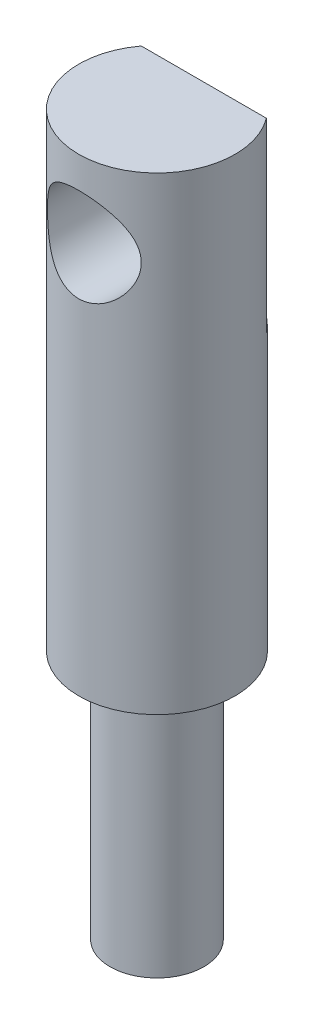
ISO-10303-21;
HEADER;
FILE_DESCRIPTION(('STEP AP214'),'2;1');
FILE_NAME('part.step','',(''),(''),'','','');
FILE_SCHEMA(('AUTOMOTIVE_DESIGN { 1 0 10303 214 1 1 1 1 }'));
ENDSEC;
DATA;
#1=APPLICATION_CONTEXT('core data for automotive mechanical design processes');
#2=APPLICATION_PROTOCOL_DEFINITION('international standard','automotive_design',2000,#1);
#3=PRODUCT_CONTEXT('',#1,'mechanical');
#4=PRODUCT('Part','Part','',(#3));
#5=PRODUCT_RELATED_PRODUCT_CATEGORY('part','',(#4));
#6=PRODUCT_DEFINITION_FORMATION('','',#4);
#7=PRODUCT_DEFINITION_CONTEXT('part definition',#1,'design');
#8=PRODUCT_DEFINITION('design','',#6,#7);
#9=PRODUCT_DEFINITION_SHAPE('','',#8);
#10=(LENGTH_UNIT() NAMED_UNIT(*) SI_UNIT(.MILLI.,.METRE.));
#11=(NAMED_UNIT(*) PLANE_ANGLE_UNIT() SI_UNIT($,.RADIAN.));
#12=(NAMED_UNIT(*) SI_UNIT($,.STERADIAN.) SOLID_ANGLE_UNIT());
#13=UNCERTAINTY_MEASURE_WITH_UNIT(LENGTH_MEASURE(1.E-05),#10,'distance_accuracy_value','');
#14=(GEOMETRIC_REPRESENTATION_CONTEXT(3) GLOBAL_UNCERTAINTY_ASSIGNED_CONTEXT((#13)) GLOBAL_UNIT_ASSIGNED_CONTEXT((#10,
#11,#12)) REPRESENTATION_CONTEXT('',''));
#15=CARTESIAN_POINT('',(0.,0.,0.));
#16=DIRECTION('',(0.,0.,1.));
#17=DIRECTION('',(1.,0.,0.));
#18=AXIS2_PLACEMENT_3D('',#15,#16,#17);
#19=CARTESIAN_POINT('',(0.,0.,0.));
#20=DIRECTION('',(0.,-1.,0.));
#21=DIRECTION('',(0.,0.,-1.));
#22=AXIS2_PLACEMENT_3D('',#19,#20,#21);
#23=PLANE('',#22);
#24=CARTESIAN_POINT('',(0.,0.,0.));
#25=DIRECTION('',(0.,1.,0.));
#26=DIRECTION('',(0.,0.,1.));
#27=AXIS2_PLACEMENT_3D('',#24,#25,#26);
#28=CIRCLE('',#27,2.5);
#29=CARTESIAN_POINT('',(-2.,0.,-1.5));
#30=VERTEX_POINT('',#29);
#31=CARTESIAN_POINT('',(2.,0.,-1.5));
#32=VERTEX_POINT('',#31);
#33=EDGE_CURVE('E11',#30,#32,#28,.T.);
#34=ORIENTED_EDGE('',*,*,#33,.T.);
#35=DIRECTION('',(1.,0.,0.));
#36=VECTOR('',#35,1.);
#37=CARTESIAN_POINT('',(-2.,0.,-1.5));
#38=LINE('',#37,#36);
#39=EDGE_CURVE('E66',#30,#32,#38,.T.);
#40=ORIENTED_EDGE('',*,*,#39,.F.);
#41=EDGE_LOOP('',(#34,#40));
#42=FACE_BOUND('',#41,.T.);
#43=ADVANCED_FACE('F38',(#42),#23,.F.);
#44=CARTESIAN_POINT('',(0.,9.18603512762904,0.));
#45=DIRECTION('',(0.,1.,0.));
#46=DIRECTION('',(0.,0.,1.));
#47=AXIS2_PLACEMENT_3D('',#44,#45,#46);
#48=CYLINDRICAL_SURFACE('',#47,2.5);
#49=CARTESIAN_POINT('',(0.,-4.,2.5));
#50=CARTESIAN_POINT('',(-0.0767298334620158,-3.99999590899012,2.49999625789732));
#51=CARTESIAN_POINT('',(-0.153582320644178,-3.99407132907374,2.4964290461501));
#52=CARTESIAN_POINT('',(-0.304975509530679,-3.97067568048467,2.48249903608568));
#53=CARTESIAN_POINT('',(-0.379510034596047,-3.95317613814578,2.47211948032719));
#54=CARTESIAN_POINT('',(-0.523751827790837,-3.90761363883314,2.44561558054488));
#55=CARTESIAN_POINT('',(-0.593481028226566,-3.87960304183684,2.42951973272944));
#56=CARTESIAN_POINT('',(-0.727030318214659,-3.81413966685897,2.39295367626407));
#57=CARTESIAN_POINT('',(-0.790851869416383,-3.77668923303125,2.37248455380255));
#58=CARTESIAN_POINT('',(-0.916299278999315,-3.69022517329142,2.32705360719088));
#59=CARTESIAN_POINT('',(-0.977384020081415,-3.64054630464861,2.30186792195985));
#60=CARTESIAN_POINT('',(-1.09088270411891,-3.53253279617173,2.25030439279634));
#61=CARTESIAN_POINT('',(-1.14328534948112,-3.47418706281268,2.22392505153571));
#62=CARTESIAN_POINT('',(-1.24444996762974,-3.34207648950327,2.1691106699591));
#63=CARTESIAN_POINT('',(-1.29197766378809,-3.26729822901871,2.14082017703649));
#64=CARTESIAN_POINT('',(-1.37361437764896,-3.10915342675689,2.08938301412124));
#65=CARTESIAN_POINT('',(-1.4077451733516,-3.02580110375243,2.06622802273938));
#66=CARTESIAN_POINT('',(-1.45440601714221,-2.87340354934676,2.0335462966093));
#67=CARTESIAN_POINT('',(-1.47016197246826,-2.80576400138968,2.02207883137591));
#68=CARTESIAN_POINT('',(-1.49216172340475,-2.66819628416964,2.00590308295503));
#69=CARTESIAN_POINT('',(-1.49841734556836,-2.59827107124551,2.0011863964376));
#70=CARTESIAN_POINT('',(-1.50105508796009,-2.45798850578267,1.99920922463856));
#71=CARTESIAN_POINT('',(-1.49741783408418,-2.3876305749068,2.00196337012718));
#72=CARTESIAN_POINT('',(-1.48046060478828,-2.24872122457241,2.01453261443742));
#73=CARTESIAN_POINT('',(-1.46713334620103,-2.18017120415256,2.02435302432226));
#74=CARTESIAN_POINT('',(-1.43173921881792,-2.0474697578719,2.04953186944258));
#75=CARTESIAN_POINT('',(-1.40978748666087,-1.98327294607552,2.06481711652537));
#76=CARTESIAN_POINT('',(-1.35795061770837,-1.85930500907188,2.09927051350828));
#77=CARTESIAN_POINT('',(-1.32806257259705,-1.79953551657608,2.11844008623465));
#78=CARTESIAN_POINT('',(-1.25517983184583,-1.6750159028772,2.16255327268985));
#79=CARTESIAN_POINT('',(-1.21080724397723,-1.61122190704507,2.18792043372992));
#80=CARTESIAN_POINT('',(-1.11291092784003,-1.49132351633299,2.23930599764381));
#81=CARTESIAN_POINT('',(-1.05937845100579,-1.43522656602349,2.26532500262149));
#82=CARTESIAN_POINT('',(-0.935811834382966,-1.32438701817824,2.31935504958317));
#83=CARTESIAN_POINT('',(-0.864517682704957,-1.27092269398401,2.34713836268532));
#84=CARTESIAN_POINT('',(-0.712276050459,-1.17687795280209,2.39772428433981));
#85=CARTESIAN_POINT('',(-0.631333763943564,-1.13629064621005,2.42052955425515));
#86=CARTESIAN_POINT('',(-0.467197585268207,-1.0720678172041,2.45730392066151));
#87=CARTESIAN_POINT('',(-0.384467624173581,-1.04752464428409,2.47173957439704));
#88=CARTESIAN_POINT('',(-0.215047895144641,-1.01298880259462,2.49218842813551));
#89=CARTESIAN_POINT('',(-0.12836300566132,-1.00297868224643,2.49821172952738));
#90=CARTESIAN_POINT('',(0.0337146143773955,-0.99849215232169,2.5009057037461));
#91=CARTESIAN_POINT('',(0.109042473418717,-1.00209114491483,2.49873521714286));
#92=CARTESIAN_POINT('',(0.25782940198606,-1.02042585307192,2.48778712087049));
#93=CARTESIAN_POINT('',(0.331288509376105,-1.03516134280581,2.47900964518037));
#94=CARTESIAN_POINT('',(0.472574932157612,-1.07454343281246,2.45594792442191));
#95=CARTESIAN_POINT('',(0.540495750928482,-1.09894034907347,2.44180275662555));
#96=CARTESIAN_POINT('',(0.671265749087261,-1.15667737636527,2.40913880862845));
#97=CARTESIAN_POINT('',(0.734113924963907,-1.19001925134667,2.39061916586511));
#98=CARTESIAN_POINT('',(0.860006262823862,-1.2685569792087,2.34845496237361));
#99=CARTESIAN_POINT('',(0.922394150456836,-1.31462382907839,2.3244780273988));
#100=CARTESIAN_POINT('',(1.03902603131014,-1.41539139348862,2.27474265574732));
#101=CARTESIAN_POINT('',(1.09326040273738,-1.47010215485253,2.24898216586361));
#102=CARTESIAN_POINT('',(1.19931996735579,-1.59491039003715,2.19445423909891));
#103=CARTESIAN_POINT('',(1.24991019630915,-1.6660838854655,2.16573241746291));
#104=CARTESIAN_POINT('',(1.33845238915667,-1.8172160245682,2.1121618206671));
#105=CARTESIAN_POINT('',(1.37641766769781,-1.89716529389278,2.0873089799769));
#106=CARTESIAN_POINT('',(1.43142578795776,-2.04624302230669,2.04984909240519));
#107=CARTESIAN_POINT('',(1.4512162533619,-2.11398031235859,2.03575659328729));
#108=CARTESIAN_POINT('',(1.48113663905972,-2.2525320780801,2.01409605743544));
#109=CARTESIAN_POINT('',(1.49127995297631,-2.32334214432783,2.00651897642721));
#110=CARTESIAN_POINT('',(1.50134130416631,-2.46637694759703,1.99900446616268));
#111=CARTESIAN_POINT('',(1.50122089107869,-2.53860599068704,1.99909576445937));
#112=CARTESIAN_POINT('',(1.49066472959328,-2.68189443560946,2.0069771789285));
#113=CARTESIAN_POINT('',(1.48022337215759,-2.7529531800806,2.0147714813882));
#114=CARTESIAN_POINT('',(1.45040174148913,-2.88848841757219,2.0363318524298));
#115=CARTESIAN_POINT('',(1.43147636845351,-2.95311709430687,2.04979211805581));
#116=CARTESIAN_POINT('',(1.38563242076993,-3.07833725447422,2.08105501960152));
#117=CARTESIAN_POINT('',(1.35871083588479,-3.13892720696055,2.09885929040482));
#118=CARTESIAN_POINT('',(1.29289245555732,-3.26431985722078,2.14012990550917));
#119=CARTESIAN_POINT('',(1.25279167675753,-3.32834110385431,2.1640458758264));
#120=CARTESIAN_POINT('',(1.16375698389084,-3.44938007261729,2.21320127030768));
#121=CARTESIAN_POINT('',(1.11481579607798,-3.50639196215256,2.23844177205021));
#122=CARTESIAN_POINT('',(1.00009777425734,-3.62135094913167,2.29225690291476));
#123=CARTESIAN_POINT('',(0.932876819313904,-3.67793107489619,2.32070308663658));
#124=CARTESIAN_POINT('',(0.788462434445589,-3.77909785586331,2.37365428872367));
#125=CARTESIAN_POINT('',(0.71126544450154,-3.82368021198479,2.39815789310936));
#126=CARTESIAN_POINT('',(0.551125230801454,-3.89778580757374,2.43985578654394));
#127=CARTESIAN_POINT('',(0.468430086957214,-3.92772806492683,2.45725077479787));
#128=CARTESIAN_POINT('',(0.297973306118807,-3.97272469521097,2.48366273001246));
#129=CARTESIAN_POINT('',(0.210232099648612,-3.98783516785699,2.49271125871485));
#130=CARTESIAN_POINT('',(0.101558096917536,-3.99669745470866,2.49802001168187));
#131=CARTESIAN_POINT('',(0.0812762590282775,-3.99793441730609,2.49876114656362));
#132=CARTESIAN_POINT('',(0.0406658206871124,-3.99958624637086,2.49975164517367));
#133=CARTESIAN_POINT('',(0.0203372186375695,-4.0000010843209,2.50000099184316));
#134=CARTESIAN_POINT('',(0.,-4.,2.5));
#135=B_SPLINE_CURVE_WITH_KNOTS('',3,(#49,#50,#51,#52,#53,#54,#55,#56,#57,#58,#59,#60,#61,#62,
#63,#64,#65,#66,#67,#68,#69,#70,#71,#72,#73,#74,#75,#76,#77,#78,#79,#80,#81,#82,#83,#84,#85,#86,
#87,#88,#89,#90,#91,#92,#93,#94,#95,#96,#97,#98,#99,#100,#101,#102,#103,#104,#105,#106,#107,
#108,#109,#110,#111,#112,#113,#114,#115,#116,#117,#118,#119,#120,#121,#122,#123,#124,#125,#126,
#127,#128,#129,#130,#131,#132,#133,#134),.UNSPECIFIED.,.T.,.F.,(4,2,2,2,2,2,2,2,2,2,2,2,2,2,2,2,
2,2,2,2,2,2,2,2,2,2,2,2,2,2,2,2,2,2,2,2,2,2,2,2,2,2,4),(0.,0.230102237548649,0.460772627520012,
0.690308884600012,0.919788197992275,1.16681590732473,1.414162579348,1.69183813189807,
1.96906040692092,2.17933829855633,2.38935420916578,2.59978170870726,2.81036753273872,
3.01823267593207,3.22617409809868,3.47046995225163,3.71500044803674,3.99360957884691,
4.27206939275324,4.53296790696559,4.79355286918235,5.01875602722426,5.24395461863455,
5.46367785689771,5.68344445659025,5.92601365818361,6.16886690081836,6.44336762428009,
6.71757792616455,6.93257787314692,7.14727888733318,7.36278425777433,7.57840681155725,
7.78364098331141,7.98895251523034,8.22578610052286,8.46281544370207,8.73854311775518,
9.01436946031985,9.28175654462676,9.54812832184448,9.60911473335177,9.6701032602764),.UNSPECIFIED.);
#136=CARTESIAN_POINT('',(0.,-4.,2.5));
#137=VERTEX_POINT('',#136);
#138=EDGE_CURVE('E73',#137,#137,#135,.T.);
#139=ORIENTED_EDGE('',*,*,#138,.T.);
#140=EDGE_LOOP('',(#139));
#141=FACE_BOUND('',#140,.T.);
#142=CARTESIAN_POINT('',(0.,-6.,0.));
#143=DIRECTION('',(0.,1.,0.));
#144=DIRECTION('',(0.,0.,1.));
#145=AXIS2_PLACEMENT_3D('',#142,#143,#144);
#146=CIRCLE('',#145,2.5);
#147=CARTESIAN_POINT('',(2.,-6.,-1.5));
#148=VERTEX_POINT('',#147);
#149=CARTESIAN_POINT('',(-2.,-6.,-1.5));
#150=VERTEX_POINT('',#149);
#151=EDGE_CURVE('E56',#148,#150,#146,.T.);
#152=ORIENTED_EDGE('',*,*,#151,.F.);
#153=DIRECTION('',(0.,1.,0.));
#154=VECTOR('',#153,1.);
#155=CARTESIAN_POINT('',(2.,-6.,-1.5));
#156=LINE('',#155,#154);
#157=EDGE_CURVE('E70',#148,#32,#156,.T.);
#158=ORIENTED_EDGE('',*,*,#157,.T.);
#159=ORIENTED_EDGE('',*,*,#33,.F.);
#160=DIRECTION('',(0.,1.,0.));
#161=VECTOR('',#160,1.);
#162=CARTESIAN_POINT('',(-2.,-6.,-1.5));
#163=LINE('',#162,#161);
#164=EDGE_CURVE('E63',#150,#30,#163,.T.);
#165=ORIENTED_EDGE('',*,*,#164,.F.);
#166=EDGE_LOOP('',(#152,#158,#159,#165));
#167=FACE_BOUND('',#166,.T.);
#168=CARTESIAN_POINT('',(0.,-15.,0.));
#169=DIRECTION('',(0.,1.,0.));
#170=DIRECTION('',(0.,0.,1.));
#171=AXIS2_PLACEMENT_3D('',#168,#169,#170);
#172=CIRCLE('',#171,2.5);
#173=CARTESIAN_POINT('',(0.,-15.,2.5));
#174=VERTEX_POINT('',#173);
#175=EDGE_CURVE('E45',#174,#174,#172,.T.);
#176=ORIENTED_EDGE('',*,*,#175,.T.);
#177=EDGE_LOOP('',(#176));
#178=FACE_BOUND('',#177,.T.);
#179=ADVANCED_FACE('F75',(#141,#167,#178),#48,.T.);
#180=CARTESIAN_POINT('',(2.5,-15.,0.));
#181=DIRECTION('',(0.,1.,0.));
#182=DIRECTION('',(0.,0.,1.));
#183=AXIS2_PLACEMENT_3D('',#180,#181,#182);
#184=PLANE('',#183);
#185=ORIENTED_EDGE('',*,*,#175,.F.);
#186=EDGE_LOOP('',(#185));
#187=FACE_BOUND('',#186,.T.);
#188=CARTESIAN_POINT('',(0.,-15.,0.));
#189=DIRECTION('',(0.,1.,0.));
#190=DIRECTION('',(0.,0.,1.));
#191=AXIS2_PLACEMENT_3D('',#188,#189,#190);
#192=CIRCLE('',#191,1.5);
#193=CARTESIAN_POINT('',(0.,-15.,1.5));
#194=VERTEX_POINT('',#193);
#195=EDGE_CURVE('E80',#194,#194,#192,.T.);
#196=ORIENTED_EDGE('',*,*,#195,.T.);
#197=EDGE_LOOP('',(#196));
#198=FACE_BOUND('',#197,.T.);
#199=ADVANCED_FACE('F88',(#187,#198),#184,.F.);
#200=CARTESIAN_POINT('',(0.,9.18603512762904,0.));
#201=DIRECTION('',(0.,1.,0.));
#202=DIRECTION('',(0.,0.,1.));
#203=AXIS2_PLACEMENT_3D('',#200,#201,#202);
#204=CYLINDRICAL_SURFACE('',#203,1.5);
#205=ORIENTED_EDGE('',*,*,#195,.F.);
#206=EDGE_LOOP('',(#205));
#207=FACE_BOUND('',#206,.T.);
#208=CARTESIAN_POINT('',(0.,-23.,0.));
#209=DIRECTION('',(0.,1.,0.));
#210=DIRECTION('',(0.,0.,1.));
#211=AXIS2_PLACEMENT_3D('',#208,#209,#210);
#212=CIRCLE('',#211,1.5);
#213=CARTESIAN_POINT('',(0.,-23.,1.5));
#214=VERTEX_POINT('',#213);
#215=EDGE_CURVE('E77',#214,#214,#212,.T.);
#216=ORIENTED_EDGE('',*,*,#215,.T.);
#217=EDGE_LOOP('',(#216));
#218=FACE_BOUND('',#217,.T.);
#219=ADVANCED_FACE('F91',(#207,#218),#204,.T.);
#220=CARTESIAN_POINT('',(1.5,-23.,0.));
#221=DIRECTION('',(0.,1.,0.));
#222=DIRECTION('',(0.,0.,1.));
#223=AXIS2_PLACEMENT_3D('',#220,#221,#222);
#224=PLANE('',#223);
#225=ORIENTED_EDGE('',*,*,#215,.F.);
#226=EDGE_LOOP('',(#225));
#227=FACE_BOUND('',#226,.T.);
#228=ADVANCED_FACE('F97',(#227),#224,.F.);
#229=CARTESIAN_POINT('',(-2.,-6.,-1.5));
#230=DIRECTION('',(0.,0.,1.));
#231=DIRECTION('',(1.,0.,0.));
#232=AXIS2_PLACEMENT_3D('',#229,#230,#231);
#233=PLANE('',#232);
#234=CARTESIAN_POINT('',(0.,-2.5,-1.5));
#235=DIRECTION('',(0.,0.,-1.));
#236=DIRECTION('',(-1.,0.,0.));
#237=AXIS2_PLACEMENT_3D('',#234,#235,#236);
#238=CIRCLE('',#237,1.5);
#239=CARTESIAN_POINT('',(-1.5,-2.5,-1.5));
#240=VERTEX_POINT('',#239);
#241=EDGE_CURVE('E124',#240,#240,#238,.T.);
#242=ORIENTED_EDGE('',*,*,#241,.F.);
#243=EDGE_LOOP('',(#242));
#244=FACE_BOUND('',#243,.T.);
#245=ORIENTED_EDGE('',*,*,#39,.T.);
#246=ORIENTED_EDGE('',*,*,#157,.F.);
#247=DIRECTION('',(1.,0.,0.));
#248=VECTOR('',#247,1.);
#249=CARTESIAN_POINT('',(-2.,-6.,-1.5));
#250=LINE('',#249,#248);
#251=EDGE_CURVE('E51',#150,#148,#250,.T.);
#252=ORIENTED_EDGE('',*,*,#251,.F.);
#253=ORIENTED_EDGE('',*,*,#164,.T.);
#254=EDGE_LOOP('',(#245,#246,#252,#253));
#255=FACE_BOUND('',#254,.T.);
#256=ADVANCED_FACE('F65',(#244,#255),#233,.F.);
#257=CARTESIAN_POINT('',(0.,-6.,0.));
#258=DIRECTION('',(0.,1.,0.));
#259=DIRECTION('',(0.,0.,1.));
#260=AXIS2_PLACEMENT_3D('',#257,#258,#259);
#261=PLANE('',#260);
#262=ORIENTED_EDGE('',*,*,#151,.T.);
#263=ORIENTED_EDGE('',*,*,#251,.T.);
#264=EDGE_LOOP('',(#262,#263));
#265=FACE_BOUND('',#264,.T.);
#266=ADVANCED_FACE('F106',(#265),#261,.T.);
#267=CARTESIAN_POINT('',(0.,-2.5,2.5));
#268=DIRECTION('',(0.,0.,-1.));
#269=DIRECTION('',(-1.,0.,0.));
#270=AXIS2_PLACEMENT_3D('',#267,#268,#269);
#271=CYLINDRICAL_SURFACE('',#270,1.5);
#272=ORIENTED_EDGE('',*,*,#241,.T.);
#273=EDGE_LOOP('',(#272));
#274=FACE_BOUND('',#273,.T.);
#275=ORIENTED_EDGE('',*,*,#138,.F.);
#276=EDGE_LOOP('',(#275));
#277=FACE_BOUND('',#276,.T.);
#278=ADVANCED_FACE('F125',(#274,#277),#271,.F.);
#279=CLOSED_SHELL('',(#43,#179,#199,#219,#228,#256,#266,#278));
#280=MANIFOLD_SOLID_BREP('B2',#279);
#281=ADVANCED_BREP_SHAPE_REPRESENTATION('',(#18,#280),#14);
#282=SHAPE_DEFINITION_REPRESENTATION(#9,#281);
ENDSEC;
END-ISO-10303-21;
